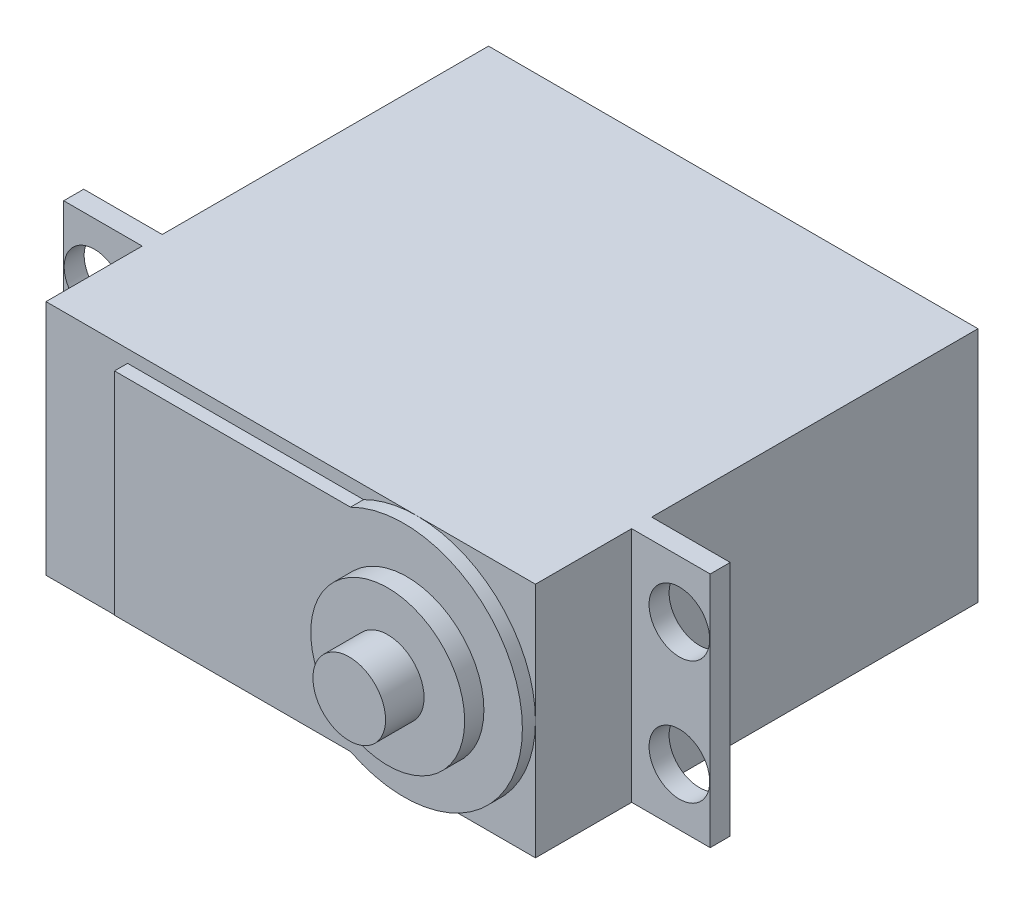
ISO-10303-21;
HEADER;
FILE_DESCRIPTION(('STEP AP214'),'2;1');
FILE_NAME('part.step','',(''),(''),'','','');
FILE_SCHEMA(('AUTOMOTIVE_DESIGN { 1 0 10303 214 1 1 1 1 }'));
ENDSEC;
DATA;
#1=APPLICATION_CONTEXT('core data for automotive mechanical design processes');
#2=APPLICATION_PROTOCOL_DEFINITION('international standard','automotive_design',2000,#1);
#3=PRODUCT_CONTEXT('',#1,'mechanical');
#4=PRODUCT('Part','Part','',(#3));
#5=PRODUCT_RELATED_PRODUCT_CATEGORY('part','',(#4));
#6=PRODUCT_DEFINITION_FORMATION('','',#4);
#7=PRODUCT_DEFINITION_CONTEXT('part definition',#1,'design');
#8=PRODUCT_DEFINITION('design','',#6,#7);
#9=PRODUCT_DEFINITION_SHAPE('','',#8);
#10=(LENGTH_UNIT() NAMED_UNIT(*) SI_UNIT(.MILLI.,.METRE.));
#11=(NAMED_UNIT(*) PLANE_ANGLE_UNIT() SI_UNIT($,.RADIAN.));
#12=(NAMED_UNIT(*) SI_UNIT($,.STERADIAN.) SOLID_ANGLE_UNIT());
#13=UNCERTAINTY_MEASURE_WITH_UNIT(LENGTH_MEASURE(1.E-05),#10,'distance_accuracy_value','');
#14=(GEOMETRIC_REPRESENTATION_CONTEXT(3) GLOBAL_UNCERTAINTY_ASSIGNED_CONTEXT((#13)) GLOBAL_UNIT_ASSIGNED_CONTEXT((#10,
#11,#12)) REPRESENTATION_CONTEXT('',''));
#15=CARTESIAN_POINT('',(0.,0.,0.));
#16=DIRECTION('',(0.,0.,1.));
#17=DIRECTION('',(1.,0.,0.));
#18=AXIS2_PLACEMENT_3D('',#15,#16,#17);
#19=CARTESIAN_POINT('',(0.,0.,36.5125));
#20=DIRECTION('',(0.,0.,1.));
#21=DIRECTION('',(1.,0.,0.));
#22=AXIS2_PLACEMENT_3D('',#19,#20,#21);
#23=PLANE('',#22);
#24=CARTESIAN_POINT('',(-43.1606186472595,-12.9670800765665,36.5125));
#25=DIRECTION('',(0.,0.,1.));
#26=DIRECTION('',(1.,0.,0.));
#27=AXIS2_PLACEMENT_3D('',#24,#25,#26);
#28=CIRCLE('',#27,9.779);
#29=CARTESIAN_POINT('',(-47.5644935816213,-21.6983300765665,36.5125));
#30=VERTEX_POINT('',#29);
#31=CARTESIAN_POINT('',(-43.1606186472595,-22.7460800765665,36.5125));
#32=VERTEX_POINT('',#31);
#33=EDGE_CURVE('E45',#30,#32,#28,.T.);
#34=ORIENTED_EDGE('',*,*,#33,.F.);
#35=DIRECTION('',(-1.,0.,0.));
#36=VECTOR('',#35,1.);
#37=CARTESIAN_POINT('',(0.,-21.6983300765665,36.5125));
#38=LINE('',#37,#36);
#39=CARTESIAN_POINT('',(-67.0366186472595,-21.6983300765665,36.5125));
#40=VERTEX_POINT('',#39);
#41=EDGE_CURVE('E52',#30,#40,#38,.T.);
#42=ORIENTED_EDGE('',*,*,#41,.T.);
#43=DIRECTION('',(0.,1.,0.));
#44=VECTOR('',#43,1.);
#45=CARTESIAN_POINT('',(-67.0366186472595,0.,36.5125));
#46=LINE('',#45,#44);
#47=CARTESIAN_POINT('',(-67.0366186472595,-4.23583007656654,36.5125));
#48=VERTEX_POINT('',#47);
#49=EDGE_CURVE('E57',#40,#48,#46,.T.);
#50=ORIENTED_EDGE('',*,*,#49,.T.);
#51=DIRECTION('',(-1.,0.,0.));
#52=VECTOR('',#51,1.);
#53=CARTESIAN_POINT('',(0.,-4.23583007656653,36.5125));
#54=LINE('',#53,#52);
#55=CARTESIAN_POINT('',(-47.5644935816213,-4.23583007656654,36.5125));
#56=VERTEX_POINT('',#55);
#57=EDGE_CURVE('E182',#56,#48,#54,.T.);
#58=ORIENTED_EDGE('',*,*,#57,.F.);
#59=CARTESIAN_POINT('',(-43.1606186472595,-3.18808007656653,36.5125));
#60=VERTEX_POINT('',#59);
#61=EDGE_CURVE('E193',#60,#56,#28,.T.);
#62=ORIENTED_EDGE('',*,*,#61,.F.);
#63=DIRECTION('',(-1.,0.,0.));
#64=VECTOR('',#63,1.);
#65=CARTESIAN_POINT('',(-73.7676186472595,-3.18808007656653,36.5125));
#66=LINE('',#65,#64);
#67=CARTESIAN_POINT('',(-73.7676186472595,-3.18808007656653,36.5125));
#68=VERTEX_POINT('',#67);
#69=EDGE_CURVE('E212',#60,#68,#66,.T.);
#70=ORIENTED_EDGE('',*,*,#69,.T.);
#71=DIRECTION('',(0.,-1.,0.));
#72=VECTOR('',#71,1.);
#73=CARTESIAN_POINT('',(-73.7676186472595,-3.18808007656653,36.5125));
#74=LINE('',#73,#72);
#75=CARTESIAN_POINT('',(-73.7676186472595,-22.7460800765665,36.5125));
#76=VERTEX_POINT('',#75);
#77=EDGE_CURVE('E200',#68,#76,#74,.T.);
#78=ORIENTED_EDGE('',*,*,#77,.T.);
#79=DIRECTION('',(1.,0.,0.));
#80=VECTOR('',#79,1.);
#81=CARTESIAN_POINT('',(-73.7676186472595,-22.7460800765665,36.5125));
#82=LINE('',#81,#80);
#83=EDGE_CURVE('E205',#76,#32,#82,.T.);
#84=ORIENTED_EDGE('',*,*,#83,.T.);
#85=EDGE_LOOP('',(#34,#42,#50,#58,#62,#70,#78,#84));
#86=FACE_BOUND('',#85,.T.);
#87=ADVANCED_FACE('F34',(#86),#23,.T.);
#88=CARTESIAN_POINT('',(-33.3816186472595,-12.9670800765665,36.5125));
#89=VERTEX_POINT('',#88);
#90=EDGE_CURVE('E11',#32,#89,#28,.T.);
#91=ORIENTED_EDGE('',*,*,#90,.F.);
#92=CARTESIAN_POINT('',(-33.3816186472595,-22.7460800765665,36.5125));
#93=VERTEX_POINT('',#92);
#94=EDGE_CURVE('E203',#32,#93,#82,.T.);
#95=ORIENTED_EDGE('',*,*,#94,.T.);
#96=DIRECTION('',(0.,1.,0.));
#97=VECTOR('',#96,1.);
#98=CARTESIAN_POINT('',(-33.3816186472595,-3.18808007656653,36.5125));
#99=LINE('',#98,#97);
#100=EDGE_CURVE('E209',#93,#89,#99,.T.);
#101=ORIENTED_EDGE('',*,*,#100,.T.);
#102=EDGE_LOOP('',(#91,#95,#101));
#103=FACE_BOUND('',#102,.T.);
#104=ADVANCED_FACE('F407',(#103),#23,.T.);
#105=CARTESIAN_POINT('',(0.,0.,28.575));
#106=DIRECTION('',(0.,0.,1.));
#107=DIRECTION('',(1.,0.,0.));
#108=AXIS2_PLACEMENT_3D('',#105,#106,#107);
#109=PLANE('',#108);
#110=DIRECTION('',(0.,-1.,0.));
#111=VECTOR('',#110,1.);
#112=CARTESIAN_POINT('',(-73.7676186472595,-3.18808007656653,28.575));
#113=LINE('',#112,#111);
#114=CARTESIAN_POINT('',(-73.7676186472595,-3.18808007656653,28.575));
#115=VERTEX_POINT('',#114);
#116=CARTESIAN_POINT('',(-73.7676186472595,-22.7460800765665,28.575));
#117=VERTEX_POINT('',#116);
#118=EDGE_CURVE('E166',#115,#117,#113,.T.);
#119=ORIENTED_EDGE('',*,*,#118,.F.);
#120=DIRECTION('',(-1.,0.,0.));
#121=VECTOR('',#120,1.);
#122=CARTESIAN_POINT('',(-80.2446186472595,-3.18808007656653,28.575));
#123=LINE('',#122,#121);
#124=CARTESIAN_POINT('',(-80.2446186472595,-3.18808007656653,28.575));
#125=VERTEX_POINT('',#124);
#126=EDGE_CURVE('E389',#115,#125,#123,.T.);
#127=ORIENTED_EDGE('',*,*,#126,.T.);
#128=DIRECTION('',(0.,-1.,0.));
#129=VECTOR('',#128,1.);
#130=CARTESIAN_POINT('',(-80.2446186472595,-3.18808007656653,28.575));
#131=LINE('',#130,#129);
#132=CARTESIAN_POINT('',(-80.2446186472595,-22.7460800765665,28.575));
#133=VERTEX_POINT('',#132);
#134=EDGE_CURVE('E277',#125,#133,#131,.T.);
#135=ORIENTED_EDGE('',*,*,#134,.T.);
#136=DIRECTION('',(1.,0.,0.));
#137=VECTOR('',#136,1.);
#138=CARTESIAN_POINT('',(-80.2446186472595,-22.7460800765665,28.575));
#139=LINE('',#138,#137);
#140=EDGE_CURVE('E290',#133,#117,#139,.T.);
#141=ORIENTED_EDGE('',*,*,#140,.T.);
#142=EDGE_LOOP('',(#119,#127,#135,#141));
#143=FACE_BOUND('',#142,.T.);
#144=CARTESIAN_POINT('',(-77.7046186472595,-7.88708007656653,28.575));
#145=DIRECTION('',(0.,0.,1.));
#146=DIRECTION('',(1.,0.,0.));
#147=AXIS2_PLACEMENT_3D('',#144,#145,#146);
#148=CIRCLE('',#147,2.50190000000001);
#149=CARTESIAN_POINT('',(-75.2027186472595,-7.88708007656653,28.575));
#150=VERTEX_POINT('',#149);
#151=EDGE_CURVE('E270',#150,#150,#148,.T.);
#152=ORIENTED_EDGE('',*,*,#151,.F.);
#153=EDGE_LOOP('',(#152));
#154=FACE_BOUND('',#153,.T.);
#155=CARTESIAN_POINT('',(-77.7046186472594,-18.0470800765665,28.575));
#156=DIRECTION('',(0.,0.,1.));
#157=DIRECTION('',(1.,0.,0.));
#158=AXIS2_PLACEMENT_3D('',#155,#156,#157);
#159=CIRCLE('',#158,2.5019);
#160=CARTESIAN_POINT('',(-75.2027186472594,-18.0470800765665,28.575));
#161=VERTEX_POINT('',#160);
#162=EDGE_CURVE('E248',#161,#161,#159,.T.);
#163=ORIENTED_EDGE('',*,*,#162,.F.);
#164=EDGE_LOOP('',(#163));
#165=FACE_BOUND('',#164,.T.);
#166=ADVANCED_FACE('F411',(#143,#154,#165),#109,.T.);
#167=CARTESIAN_POINT('',(-73.7676186472595,-3.18808007656653,26.924));
#168=DIRECTION('',(1.,0.,0.));
#169=DIRECTION('',(0.,0.,-1.));
#170=AXIS2_PLACEMENT_3D('',#167,#168,#169);
#171=PLANE('',#170);
#172=DIRECTION('',(0.,-1.,0.));
#173=VECTOR('',#172,1.);
#174=CARTESIAN_POINT('',(-73.7676186472595,-3.18808007656653,0.));
#175=LINE('',#174,#173);
#176=CARTESIAN_POINT('',(-73.7676186472595,-3.18808007656653,0.));
#177=VERTEX_POINT('',#176);
#178=CARTESIAN_POINT('',(-73.7676186472595,-22.7460800765665,0.));
#179=VERTEX_POINT('',#178);
#180=EDGE_CURVE('E320',#177,#179,#175,.T.);
#181=ORIENTED_EDGE('',*,*,#180,.T.);
#182=DIRECTION('',(0.,0.,-1.));
#183=VECTOR('',#182,1.);
#184=CARTESIAN_POINT('',(-73.7676186472595,-22.7460800765665,26.924));
#185=LINE('',#184,#183);
#186=CARTESIAN_POINT('',(-73.7676186472595,-22.7460800765665,26.924));
#187=VERTEX_POINT('',#186);
#188=EDGE_CURVE('E301',#187,#179,#185,.T.);
#189=ORIENTED_EDGE('',*,*,#188,.F.);
#190=DIRECTION('',(0.,-1.,0.));
#191=VECTOR('',#190,1.);
#192=CARTESIAN_POINT('',(-73.7676186472595,-3.18808007656653,26.924));
#193=LINE('',#192,#191);
#194=CARTESIAN_POINT('',(-73.7676186472595,-3.18808007656653,26.924));
#195=VERTEX_POINT('',#194);
#196=EDGE_CURVE('E305',#195,#187,#193,.T.);
#197=ORIENTED_EDGE('',*,*,#196,.F.);
#198=DIRECTION('',(0.,0.,-1.));
#199=VECTOR('',#198,1.);
#200=CARTESIAN_POINT('',(-73.7676186472595,-3.18808007656653,26.924));
#201=LINE('',#200,#199);
#202=EDGE_CURVE('E294',#195,#177,#201,.T.);
#203=ORIENTED_EDGE('',*,*,#202,.T.);
#204=EDGE_LOOP('',(#181,#189,#197,#203));
#205=FACE_BOUND('',#204,.T.);
#206=ADVANCED_FACE('F36',(#205),#171,.F.);
#207=CARTESIAN_POINT('',(-73.7676186472595,-22.7460800765665,26.924));
#208=DIRECTION('',(0.,1.,0.));
#209=DIRECTION('',(0.,0.,1.));
#210=AXIS2_PLACEMENT_3D('',#207,#208,#209);
#211=PLANE('',#210);
#212=DIRECTION('',(1.,0.,0.));
#213=VECTOR('',#212,1.);
#214=CARTESIAN_POINT('',(-73.7676186472595,-22.7460800765665,0.));
#215=LINE('',#214,#213);
#216=CARTESIAN_POINT('',(-33.3816186472595,-22.7460800765665,0.));
#217=VERTEX_POINT('',#216);
#218=EDGE_CURVE('E337',#179,#217,#215,.T.);
#219=ORIENTED_EDGE('',*,*,#218,.T.);
#220=DIRECTION('',(0.,0.,-1.));
#221=VECTOR('',#220,1.);
#222=CARTESIAN_POINT('',(-33.3816186472595,-22.7460800765665,26.924));
#223=LINE('',#222,#221);
#224=CARTESIAN_POINT('',(-33.3816186472595,-22.7460800765665,26.924));
#225=VERTEX_POINT('',#224);
#226=EDGE_CURVE('E304',#225,#217,#223,.T.);
#227=ORIENTED_EDGE('',*,*,#226,.F.);
#228=DIRECTION('',(1.,0.,0.));
#229=VECTOR('',#228,1.);
#230=CARTESIAN_POINT('',(-80.2446186472595,-22.7460800765665,26.924));
#231=LINE('',#230,#229);
#232=CARTESIAN_POINT('',(-26.9046186472595,-22.7460800765665,26.924));
#233=VERTEX_POINT('',#232);
#234=EDGE_CURVE('E315',#225,#233,#231,.T.);
#235=ORIENTED_EDGE('',*,*,#234,.T.);
#236=DIRECTION('',(0.,0.,-1.));
#237=VECTOR('',#236,1.);
#238=CARTESIAN_POINT('',(-26.9046186472595,-22.7460800765665,28.575));
#239=LINE('',#238,#237);
#240=CARTESIAN_POINT('',(-26.9046186472595,-22.7460800765665,28.575));
#241=VERTEX_POINT('',#240);
#242=EDGE_CURVE('E343',#241,#233,#239,.T.);
#243=ORIENTED_EDGE('',*,*,#242,.F.);
#244=CARTESIAN_POINT('',(-33.3816186472595,-22.7460800765665,28.575));
#245=VERTEX_POINT('',#244);
#246=EDGE_CURVE('E280',#245,#241,#139,.T.);
#247=ORIENTED_EDGE('',*,*,#246,.F.);
#248=DIRECTION('',(0.,0.,-1.));
#249=VECTOR('',#248,1.);
#250=CARTESIAN_POINT('',(-33.3816186472595,-22.7460800765665,36.5125));
#251=LINE('',#250,#249);
#252=EDGE_CURVE('E232',#93,#245,#251,.T.);
#253=ORIENTED_EDGE('',*,*,#252,.F.);
#254=ORIENTED_EDGE('',*,*,#94,.F.);
#255=ORIENTED_EDGE('',*,*,#83,.F.);
#256=DIRECTION('',(0.,0.,-1.));
#257=VECTOR('',#256,1.);
#258=CARTESIAN_POINT('',(-73.7676186472595,-22.7460800765665,36.5125));
#259=LINE('',#258,#257);
#260=EDGE_CURVE('E239',#76,#117,#259,.T.);
#261=ORIENTED_EDGE('',*,*,#260,.T.);
#262=ORIENTED_EDGE('',*,*,#140,.F.);
#263=DIRECTION('',(0.,0.,-1.));
#264=VECTOR('',#263,1.);
#265=CARTESIAN_POINT('',(-80.2446186472595,-22.7460800765665,28.575));
#266=LINE('',#265,#264);
#267=CARTESIAN_POINT('',(-80.2446186472595,-22.7460800765665,26.924));
#268=VERTEX_POINT('',#267);
#269=EDGE_CURVE('E339',#133,#268,#266,.T.);
#270=ORIENTED_EDGE('',*,*,#269,.T.);
#271=EDGE_CURVE('E383',#268,#187,#231,.T.);
#272=ORIENTED_EDGE('',*,*,#271,.T.);
#273=ORIENTED_EDGE('',*,*,#188,.T.);
#274=EDGE_LOOP('',(#219,#227,#235,#243,#247,#253,#254,#255,#261,#262,#270,#272,#273));
#275=FACE_BOUND('',#274,.T.);
#276=ADVANCED_FACE('F399',(#275),#211,.F.);
#277=CARTESIAN_POINT('',(-33.3816186472595,-3.18808007656653,26.924));
#278=DIRECTION('',(-1.,0.,0.));
#279=DIRECTION('',(0.,0.,1.));
#280=AXIS2_PLACEMENT_3D('',#277,#278,#279);
#281=PLANE('',#280);
#282=DIRECTION('',(0.,1.,0.));
#283=VECTOR('',#282,1.);
#284=CARTESIAN_POINT('',(-33.3816186472595,-3.18808007656653,0.));
#285=LINE('',#284,#283);
#286=CARTESIAN_POINT('',(-33.3816186472595,-3.18808007656653,0.));
#287=VERTEX_POINT('',#286);
#288=EDGE_CURVE('E336',#217,#287,#285,.T.);
#289=ORIENTED_EDGE('',*,*,#288,.T.);
#290=DIRECTION('',(0.,0.,-1.));
#291=VECTOR('',#290,1.);
#292=CARTESIAN_POINT('',(-33.3816186472595,-3.18808007656653,26.924));
#293=LINE('',#292,#291);
#294=CARTESIAN_POINT('',(-33.3816186472595,-3.18808007656653,26.924));
#295=VERTEX_POINT('',#294);
#296=EDGE_CURVE('E297',#295,#287,#293,.T.);
#297=ORIENTED_EDGE('',*,*,#296,.F.);
#298=DIRECTION('',(0.,1.,0.));
#299=VECTOR('',#298,1.);
#300=CARTESIAN_POINT('',(-33.3816186472595,-3.18808007656653,26.924));
#301=LINE('',#300,#299);
#302=EDGE_CURVE('E298',#225,#295,#301,.T.);
#303=ORIENTED_EDGE('',*,*,#302,.F.);
#304=ORIENTED_EDGE('',*,*,#226,.T.);
#305=EDGE_LOOP('',(#289,#297,#303,#304));
#306=FACE_BOUND('',#305,.T.);
#307=ADVANCED_FACE('F374',(#306),#281,.F.);
#308=CARTESIAN_POINT('',(-73.7676186472595,-3.18808007656653,26.924));
#309=DIRECTION('',(0.,-1.,0.));
#310=DIRECTION('',(0.,0.,-1.));
#311=AXIS2_PLACEMENT_3D('',#308,#309,#310);
#312=PLANE('',#311);
#313=DIRECTION('',(-1.,0.,0.));
#314=VECTOR('',#313,1.);
#315=CARTESIAN_POINT('',(-73.7676186472595,-3.18808007656653,0.));
#316=LINE('',#315,#314);
#317=EDGE_CURVE('E309',#287,#177,#316,.T.);
#318=ORIENTED_EDGE('',*,*,#317,.T.);
#319=ORIENTED_EDGE('',*,*,#202,.F.);
#320=DIRECTION('',(-1.,0.,0.));
#321=VECTOR('',#320,1.);
#322=CARTESIAN_POINT('',(-80.2446186472595,-3.18808007656653,26.924));
#323=LINE('',#322,#321);
#324=CARTESIAN_POINT('',(-80.2446186472595,-3.18808007656653,26.924));
#325=VERTEX_POINT('',#324);
#326=EDGE_CURVE('E355',#195,#325,#323,.T.);
#327=ORIENTED_EDGE('',*,*,#326,.T.);
#328=DIRECTION('',(0.,0.,-1.));
#329=VECTOR('',#328,1.);
#330=CARTESIAN_POINT('',(-80.2446186472595,-3.18808007656653,28.575));
#331=LINE('',#330,#329);
#332=EDGE_CURVE('E360',#125,#325,#331,.T.);
#333=ORIENTED_EDGE('',*,*,#332,.F.);
#334=ORIENTED_EDGE('',*,*,#126,.F.);
#335=DIRECTION('',(0.,0.,-1.));
#336=VECTOR('',#335,1.);
#337=CARTESIAN_POINT('',(-73.7676186472595,-3.18808007656653,36.5125));
#338=LINE('',#337,#336);
#339=EDGE_CURVE('E216',#68,#115,#338,.T.);
#340=ORIENTED_EDGE('',*,*,#339,.F.);
#341=ORIENTED_EDGE('',*,*,#69,.F.);
#342=CARTESIAN_POINT('',(-33.3816186472595,-3.18808007656653,36.5125));
#343=VERTEX_POINT('',#342);
#344=EDGE_CURVE('E213',#343,#60,#66,.T.);
#345=ORIENTED_EDGE('',*,*,#344,.F.);
#346=DIRECTION('',(0.,0.,-1.));
#347=VECTOR('',#346,1.);
#348=CARTESIAN_POINT('',(-33.3816186472595,-3.18808007656653,36.5125));
#349=LINE('',#348,#347);
#350=CARTESIAN_POINT('',(-33.3816186472595,-3.18808007656653,28.575));
#351=VERTEX_POINT('',#350);
#352=EDGE_CURVE('E227',#343,#351,#349,.T.);
#353=ORIENTED_EDGE('',*,*,#352,.T.);
#354=CARTESIAN_POINT('',(-26.9046186472595,-3.18808007656653,28.575));
#355=VERTEX_POINT('',#354);
#356=EDGE_CURVE('E363',#355,#351,#123,.T.);
#357=ORIENTED_EDGE('',*,*,#356,.F.);
#358=DIRECTION('',(0.,0.,-1.));
#359=VECTOR('',#358,1.);
#360=CARTESIAN_POINT('',(-26.9046186472595,-3.18808007656653,28.575));
#361=LINE('',#360,#359);
#362=CARTESIAN_POINT('',(-26.9046186472595,-3.18808007656653,26.924));
#363=VERTEX_POINT('',#362);
#364=EDGE_CURVE('E349',#355,#363,#361,.T.);
#365=ORIENTED_EDGE('',*,*,#364,.T.);
#366=EDGE_CURVE('E281',#363,#295,#323,.T.);
#367=ORIENTED_EDGE('',*,*,#366,.T.);
#368=ORIENTED_EDGE('',*,*,#296,.T.);
#369=EDGE_LOOP('',(#318,#319,#327,#333,#334,#340,#341,#345,#353,#357,#365,#367,#368));
#370=FACE_BOUND('',#369,.T.);
#371=ADVANCED_FACE('F367',(#370),#312,.F.);
#372=CARTESIAN_POINT('',(0.,0.,0.));
#373=DIRECTION('',(0.,0.,1.));
#374=DIRECTION('',(1.,0.,0.));
#375=AXIS2_PLACEMENT_3D('',#372,#373,#374);
#376=PLANE('',#375);
#377=ORIENTED_EDGE('',*,*,#180,.F.);
#378=ORIENTED_EDGE('',*,*,#317,.F.);
#379=ORIENTED_EDGE('',*,*,#288,.F.);
#380=ORIENTED_EDGE('',*,*,#218,.F.);
#381=EDGE_LOOP('',(#377,#378,#379,#380));
#382=FACE_BOUND('',#381,.T.);
#383=ADVANCED_FACE('F376',(#382),#376,.F.);
#384=CARTESIAN_POINT('',(0.,0.,26.924));
#385=DIRECTION('',(0.,0.,1.));
#386=DIRECTION('',(1.,0.,0.));
#387=AXIS2_PLACEMENT_3D('',#384,#385,#386);
#388=PLANE('',#387);
#389=CARTESIAN_POINT('',(-77.7046186472594,-18.0470800765665,26.924));
#390=DIRECTION('',(0.,0.,1.));
#391=DIRECTION('',(1.,0.,0.));
#392=AXIS2_PLACEMENT_3D('',#389,#390,#391);
#393=CIRCLE('',#392,2.5019);
#394=CARTESIAN_POINT('',(-75.2027186472594,-18.0470800765665,26.924));
#395=VERTEX_POINT('',#394);
#396=EDGE_CURVE('E252',#395,#395,#393,.T.);
#397=ORIENTED_EDGE('',*,*,#396,.T.);
#398=EDGE_LOOP('',(#397));
#399=FACE_BOUND('',#398,.T.);
#400=CARTESIAN_POINT('',(-77.7046186472595,-7.88708007656653,26.924));
#401=DIRECTION('',(0.,0.,1.));
#402=DIRECTION('',(1.,0.,0.));
#403=AXIS2_PLACEMENT_3D('',#400,#401,#402);
#404=CIRCLE('',#403,2.50190000000001);
#405=CARTESIAN_POINT('',(-75.2027186472595,-7.88708007656653,26.924));
#406=VERTEX_POINT('',#405);
#407=EDGE_CURVE('E273',#406,#406,#404,.T.);
#408=ORIENTED_EDGE('',*,*,#407,.T.);
#409=EDGE_LOOP('',(#408));
#410=FACE_BOUND('',#409,.T.);
#411=ORIENTED_EDGE('',*,*,#326,.F.);
#412=ORIENTED_EDGE('',*,*,#196,.T.);
#413=ORIENTED_EDGE('',*,*,#271,.F.);
#414=DIRECTION('',(0.,-1.,0.));
#415=VECTOR('',#414,1.);
#416=CARTESIAN_POINT('',(-80.2446186472595,-3.18808007656653,26.924));
#417=LINE('',#416,#415);
#418=EDGE_CURVE('E276',#325,#268,#417,.T.);
#419=ORIENTED_EDGE('',*,*,#418,.F.);
#420=EDGE_LOOP('',(#411,#412,#413,#419));
#421=FACE_BOUND('',#420,.T.);
#422=ADVANCED_FACE('F381',(#399,#410,#421),#388,.F.);
#423=CARTESIAN_POINT('',(-29.4446186472594,-18.0470800765665,26.924));
#424=DIRECTION('',(0.,0.,1.));
#425=DIRECTION('',(1.,0.,0.));
#426=AXIS2_PLACEMENT_3D('',#423,#424,#425);
#427=CIRCLE('',#426,2.5019);
#428=CARTESIAN_POINT('',(-26.9427186472594,-18.0470800765665,26.924));
#429=VERTEX_POINT('',#428);
#430=EDGE_CURVE('E261',#429,#429,#427,.T.);
#431=ORIENTED_EDGE('',*,*,#430,.T.);
#432=EDGE_LOOP('',(#431));
#433=FACE_BOUND('',#432,.T.);
#434=CARTESIAN_POINT('',(-29.4446186472595,-7.88708007656653,26.924));
#435=DIRECTION('',(0.,0.,1.));
#436=DIRECTION('',(1.,0.,0.));
#437=AXIS2_PLACEMENT_3D('',#434,#435,#436);
#438=CIRCLE('',#437,2.50190000000001);
#439=CARTESIAN_POINT('',(-26.9427186472595,-7.88708007656653,26.924));
#440=VERTEX_POINT('',#439);
#441=EDGE_CURVE('E267',#440,#440,#438,.T.);
#442=ORIENTED_EDGE('',*,*,#441,.T.);
#443=EDGE_LOOP('',(#442));
#444=FACE_BOUND('',#443,.T.);
#445=ORIENTED_EDGE('',*,*,#234,.F.);
#446=ORIENTED_EDGE('',*,*,#302,.T.);
#447=ORIENTED_EDGE('',*,*,#366,.F.);
#448=DIRECTION('',(0.,1.,0.));
#449=VECTOR('',#448,1.);
#450=CARTESIAN_POINT('',(-26.9046186472595,-3.18808007656653,26.924));
#451=LINE('',#450,#449);
#452=EDGE_CURVE('E359',#233,#363,#451,.T.);
#453=ORIENTED_EDGE('',*,*,#452,.F.);
#454=EDGE_LOOP('',(#445,#446,#447,#453));
#455=FACE_BOUND('',#454,.T.);
#456=ADVANCED_FACE('F373',(#433,#444,#455),#388,.F.);
#457=CARTESIAN_POINT('',(-80.2446186472595,-3.18808007656653,28.575));
#458=DIRECTION('',(1.,0.,0.));
#459=DIRECTION('',(0.,0.,-1.));
#460=AXIS2_PLACEMENT_3D('',#457,#458,#459);
#461=PLANE('',#460);
#462=ORIENTED_EDGE('',*,*,#418,.T.);
#463=ORIENTED_EDGE('',*,*,#269,.F.);
#464=ORIENTED_EDGE('',*,*,#134,.F.);
#465=ORIENTED_EDGE('',*,*,#332,.T.);
#466=EDGE_LOOP('',(#462,#463,#464,#465));
#467=FACE_BOUND('',#466,.T.);
#468=ADVANCED_FACE('F415',(#467),#461,.F.);
#469=CARTESIAN_POINT('',(-26.9046186472595,-3.18808007656653,28.575));
#470=DIRECTION('',(-1.,0.,0.));
#471=DIRECTION('',(0.,0.,1.));
#472=AXIS2_PLACEMENT_3D('',#469,#470,#471);
#473=PLANE('',#472);
#474=ORIENTED_EDGE('',*,*,#452,.T.);
#475=ORIENTED_EDGE('',*,*,#364,.F.);
#476=DIRECTION('',(0.,1.,0.));
#477=VECTOR('',#476,1.);
#478=CARTESIAN_POINT('',(-26.9046186472595,-3.18808007656653,28.575));
#479=LINE('',#478,#477);
#480=EDGE_CURVE('E284',#241,#355,#479,.T.);
#481=ORIENTED_EDGE('',*,*,#480,.F.);
#482=ORIENTED_EDGE('',*,*,#242,.T.);
#483=EDGE_LOOP('',(#474,#475,#481,#482));
#484=FACE_BOUND('',#483,.T.);
#485=ADVANCED_FACE('F398',(#484),#473,.F.);
#486=DIRECTION('',(0.,1.,0.));
#487=VECTOR('',#486,1.);
#488=CARTESIAN_POINT('',(-33.3816186472595,-3.18808007656653,28.575));
#489=LINE('',#488,#487);
#490=EDGE_CURVE('E204',#245,#351,#489,.T.);
#491=ORIENTED_EDGE('',*,*,#490,.F.);
#492=ORIENTED_EDGE('',*,*,#246,.T.);
#493=ORIENTED_EDGE('',*,*,#480,.T.);
#494=ORIENTED_EDGE('',*,*,#356,.T.);
#495=EDGE_LOOP('',(#491,#492,#493,#494));
#496=FACE_BOUND('',#495,.T.);
#497=CARTESIAN_POINT('',(-29.4446186472594,-18.0470800765665,28.575));
#498=DIRECTION('',(0.,0.,1.));
#499=DIRECTION('',(1.,0.,0.));
#500=AXIS2_PLACEMENT_3D('',#497,#498,#499);
#501=CIRCLE('',#500,2.5019);
#502=CARTESIAN_POINT('',(-26.9427186472594,-18.0470800765665,28.575));
#503=VERTEX_POINT('',#502);
#504=EDGE_CURVE('E256',#503,#503,#501,.T.);
#505=ORIENTED_EDGE('',*,*,#504,.F.);
#506=EDGE_LOOP('',(#505));
#507=FACE_BOUND('',#506,.T.);
#508=CARTESIAN_POINT('',(-29.4446186472595,-7.88708007656653,28.575));
#509=DIRECTION('',(0.,0.,1.));
#510=DIRECTION('',(1.,0.,0.));
#511=AXIS2_PLACEMENT_3D('',#508,#509,#510);
#512=CIRCLE('',#511,2.50190000000001);
#513=CARTESIAN_POINT('',(-26.9427186472595,-7.88708007656653,28.575));
#514=VERTEX_POINT('',#513);
#515=EDGE_CURVE('E264',#514,#514,#512,.T.);
#516=ORIENTED_EDGE('',*,*,#515,.F.);
#517=EDGE_LOOP('',(#516));
#518=FACE_BOUND('',#517,.T.);
#519=ADVANCED_FACE('F394',(#496,#507,#518),#109,.T.);
#520=CARTESIAN_POINT('',(-77.7046186472595,-7.88708007656653,25.4));
#521=DIRECTION('',(0.,0.,1.));
#522=DIRECTION('',(1.,0.,0.));
#523=AXIS2_PLACEMENT_3D('',#520,#521,#522);
#524=CYLINDRICAL_SURFACE('',#523,2.50190000000001);
#525=ORIENTED_EDGE('',*,*,#151,.T.);
#526=EDGE_LOOP('',(#525));
#527=FACE_BOUND('',#526,.T.);
#528=ORIENTED_EDGE('',*,*,#407,.F.);
#529=EDGE_LOOP('',(#528));
#530=FACE_BOUND('',#529,.T.);
#531=ADVANCED_FACE('F619',(#527,#530),#524,.F.);
#532=CARTESIAN_POINT('',(-29.4446186472595,-7.88708007656653,25.4));
#533=DIRECTION('',(0.,0.,1.));
#534=DIRECTION('',(1.,0.,0.));
#535=AXIS2_PLACEMENT_3D('',#532,#533,#534);
#536=CYLINDRICAL_SURFACE('',#535,2.50190000000001);
#537=ORIENTED_EDGE('',*,*,#515,.T.);
#538=EDGE_LOOP('',(#537));
#539=FACE_BOUND('',#538,.T.);
#540=ORIENTED_EDGE('',*,*,#441,.F.);
#541=EDGE_LOOP('',(#540));
#542=FACE_BOUND('',#541,.T.);
#543=ADVANCED_FACE('F610',(#539,#542),#536,.F.);
#544=CARTESIAN_POINT('',(-29.4446186472594,-18.0470800765665,25.4));
#545=DIRECTION('',(0.,0.,1.));
#546=DIRECTION('',(1.,0.,0.));
#547=AXIS2_PLACEMENT_3D('',#544,#545,#546);
#548=CYLINDRICAL_SURFACE('',#547,2.5019);
#549=ORIENTED_EDGE('',*,*,#504,.T.);
#550=EDGE_LOOP('',(#549));
#551=FACE_BOUND('',#550,.T.);
#552=ORIENTED_EDGE('',*,*,#430,.F.);
#553=EDGE_LOOP('',(#552));
#554=FACE_BOUND('',#553,.T.);
#555=ADVANCED_FACE('F602',(#551,#554),#548,.F.);
#556=CARTESIAN_POINT('',(-77.7046186472594,-18.0470800765665,25.4));
#557=DIRECTION('',(0.,0.,1.));
#558=DIRECTION('',(1.,0.,0.));
#559=AXIS2_PLACEMENT_3D('',#556,#557,#558);
#560=CYLINDRICAL_SURFACE('',#559,2.5019);
#561=ORIENTED_EDGE('',*,*,#162,.T.);
#562=EDGE_LOOP('',(#561));
#563=FACE_BOUND('',#562,.T.);
#564=ORIENTED_EDGE('',*,*,#396,.F.);
#565=EDGE_LOOP('',(#564));
#566=FACE_BOUND('',#565,.T.);
#567=ADVANCED_FACE('F565',(#563,#566),#560,.F.);
#568=CARTESIAN_POINT('',(-73.7676186472595,-3.18808007656653,36.5125));
#569=DIRECTION('',(1.,0.,0.));
#570=DIRECTION('',(0.,0.,-1.));
#571=AXIS2_PLACEMENT_3D('',#568,#569,#570);
#572=PLANE('',#571);
#573=ORIENTED_EDGE('',*,*,#118,.T.);
#574=ORIENTED_EDGE('',*,*,#260,.F.);
#575=ORIENTED_EDGE('',*,*,#77,.F.);
#576=ORIENTED_EDGE('',*,*,#339,.T.);
#577=EDGE_LOOP('',(#573,#574,#575,#576));
#578=FACE_BOUND('',#577,.T.);
#579=ADVANCED_FACE('F410',(#578),#572,.F.);
#580=CARTESIAN_POINT('',(-33.3816186472595,-3.18808007656653,36.5125));
#581=DIRECTION('',(-1.,0.,0.));
#582=DIRECTION('',(0.,0.,1.));
#583=AXIS2_PLACEMENT_3D('',#580,#581,#582);
#584=PLANE('',#583);
#585=ORIENTED_EDGE('',*,*,#490,.T.);
#586=ORIENTED_EDGE('',*,*,#352,.F.);
#587=EDGE_CURVE('E208',#89,#343,#99,.T.);
#588=ORIENTED_EDGE('',*,*,#587,.F.);
#589=ORIENTED_EDGE('',*,*,#100,.F.);
#590=ORIENTED_EDGE('',*,*,#252,.T.);
#591=EDGE_LOOP('',(#585,#586,#588,#589,#590));
#592=FACE_BOUND('',#591,.T.);
#593=ADVANCED_FACE('F404',(#592),#584,.F.);
#594=EDGE_CURVE('E43',#89,#60,#28,.T.);
#595=ORIENTED_EDGE('',*,*,#594,.F.);
#596=ORIENTED_EDGE('',*,*,#587,.T.);
#597=ORIENTED_EDGE('',*,*,#344,.T.);
#598=EDGE_LOOP('',(#595,#596,#597));
#599=FACE_BOUND('',#598,.T.);
#600=ADVANCED_FACE('F428',(#599),#23,.T.);
#601=CARTESIAN_POINT('',(0.,-21.6983300765665,37.592));
#602=DIRECTION('',(0.,-1.,0.));
#603=DIRECTION('',(1.,0.,0.));
#604=AXIS2_PLACEMENT_3D('',#601,#602,#603);
#605=PLANE('',#604);
#606=ORIENTED_EDGE('',*,*,#41,.F.);
#607=DIRECTION('',(0.,0.,-1.));
#608=VECTOR('',#607,1.);
#609=CARTESIAN_POINT('',(-47.5644935816213,-21.6983300765665,37.592));
#610=LINE('',#609,#608);
#611=CARTESIAN_POINT('',(-47.5644935816213,-21.6983300765665,37.592));
#612=VERTEX_POINT('',#611);
#613=EDGE_CURVE('E158',#612,#30,#610,.T.);
#614=ORIENTED_EDGE('',*,*,#613,.F.);
#615=DIRECTION('',(-1.,0.,0.));
#616=VECTOR('',#615,1.);
#617=CARTESIAN_POINT('',(0.,-21.6983300765665,37.592));
#618=LINE('',#617,#616);
#619=CARTESIAN_POINT('',(-67.0366186472595,-21.6983300765665,37.592));
#620=VERTEX_POINT('',#619);
#621=EDGE_CURVE('E162',#612,#620,#618,.T.);
#622=ORIENTED_EDGE('',*,*,#621,.T.);
#623=DIRECTION('',(0.,0.,-1.));
#624=VECTOR('',#623,1.);
#625=CARTESIAN_POINT('',(-67.0366186472595,-21.6983300765665,37.592));
#626=LINE('',#625,#624);
#627=EDGE_CURVE('E190',#620,#40,#626,.T.);
#628=ORIENTED_EDGE('',*,*,#627,.T.);
#629=EDGE_LOOP('',(#606,#614,#622,#628));
#630=FACE_BOUND('',#629,.T.);
#631=ADVANCED_FACE('F160',(#630),#605,.T.);
#632=CARTESIAN_POINT('',(-43.1606186472595,-12.9670800765665,37.592));
#633=DIRECTION('',(0.,0.,-1.));
#634=DIRECTION('',(-1.,0.,0.));
#635=AXIS2_PLACEMENT_3D('',#632,#633,#634);
#636=CYLINDRICAL_SURFACE('',#635,9.779);
#637=ORIENTED_EDGE('',*,*,#33,.T.);
#638=ORIENTED_EDGE('',*,*,#90,.T.);
#639=ORIENTED_EDGE('',*,*,#594,.T.);
#640=ORIENTED_EDGE('',*,*,#61,.T.);
#641=DIRECTION('',(0.,0.,-1.));
#642=VECTOR('',#641,1.);
#643=CARTESIAN_POINT('',(-47.5644935816213,-4.23583007656654,37.592));
#644=LINE('',#643,#642);
#645=CARTESIAN_POINT('',(-47.5644935816213,-4.23583007656654,37.592));
#646=VERTEX_POINT('',#645);
#647=EDGE_CURVE('E167',#646,#56,#644,.T.);
#648=ORIENTED_EDGE('',*,*,#647,.F.);
#649=CARTESIAN_POINT('',(-43.1606186472595,-12.9670800765665,37.592));
#650=DIRECTION('',(0.,0.,1.));
#651=DIRECTION('',(1.,0.,0.));
#652=AXIS2_PLACEMENT_3D('',#649,#650,#651);
#653=CIRCLE('',#652,9.779);
#654=EDGE_CURVE('E170',#612,#646,#653,.T.);
#655=ORIENTED_EDGE('',*,*,#654,.F.);
#656=ORIENTED_EDGE('',*,*,#613,.T.);
#657=EDGE_LOOP('',(#637,#638,#639,#640,#648,#655,#656));
#658=FACE_BOUND('',#657,.T.);
#659=ADVANCED_FACE('F171',(#658),#636,.T.);
#660=CARTESIAN_POINT('',(0.,-4.23583007656653,37.592));
#661=DIRECTION('',(0.,-1.,0.));
#662=DIRECTION('',(1.,0.,0.));
#663=AXIS2_PLACEMENT_3D('',#660,#661,#662);
#664=PLANE('',#663);
#665=ORIENTED_EDGE('',*,*,#57,.T.);
#666=DIRECTION('',(0.,0.,-1.));
#667=VECTOR('',#666,1.);
#668=CARTESIAN_POINT('',(-67.0366186472595,-4.23583007656654,37.592));
#669=LINE('',#668,#667);
#670=CARTESIAN_POINT('',(-67.0366186472595,-4.23583007656654,37.592));
#671=VERTEX_POINT('',#670);
#672=EDGE_CURVE('E197',#671,#48,#669,.T.);
#673=ORIENTED_EDGE('',*,*,#672,.F.);
#674=DIRECTION('',(-1.,0.,0.));
#675=VECTOR('',#674,1.);
#676=CARTESIAN_POINT('',(0.,-4.23583007656653,37.592));
#677=LINE('',#676,#675);
#678=EDGE_CURVE('E176',#646,#671,#677,.T.);
#679=ORIENTED_EDGE('',*,*,#678,.F.);
#680=ORIENTED_EDGE('',*,*,#647,.T.);
#681=EDGE_LOOP('',(#665,#673,#679,#680));
#682=FACE_BOUND('',#681,.T.);
#683=ADVANCED_FACE('F441',(#682),#664,.F.);
#684=CARTESIAN_POINT('',(-67.0366186472595,0.,37.592));
#685=DIRECTION('',(-1.,0.,0.));
#686=DIRECTION('',(0.,0.,1.));
#687=AXIS2_PLACEMENT_3D('',#684,#685,#686);
#688=PLANE('',#687);
#689=ORIENTED_EDGE('',*,*,#49,.F.);
#690=ORIENTED_EDGE('',*,*,#627,.F.);
#691=DIRECTION('',(0.,1.,0.));
#692=VECTOR('',#691,1.);
#693=CARTESIAN_POINT('',(-67.0366186472595,0.,37.592));
#694=LINE('',#693,#692);
#695=EDGE_CURVE('E180',#620,#671,#694,.T.);
#696=ORIENTED_EDGE('',*,*,#695,.T.);
#697=ORIENTED_EDGE('',*,*,#672,.T.);
#698=EDGE_LOOP('',(#689,#690,#696,#697));
#699=FACE_BOUND('',#698,.T.);
#700=ADVANCED_FACE('F444',(#699),#688,.T.);
#701=CARTESIAN_POINT('',(0.,0.,37.592));
#702=DIRECTION('',(0.,0.,1.));
#703=DIRECTION('',(1.,0.,0.));
#704=AXIS2_PLACEMENT_3D('',#701,#702,#703);
#705=PLANE('',#704);
#706=CARTESIAN_POINT('',(-42.9066186472595,-13.2210800765665,37.592));
#707=DIRECTION('',(0.,0.,1.));
#708=DIRECTION('',(1.,0.,0.));
#709=AXIS2_PLACEMENT_3D('',#706,#707,#708);
#710=CIRCLE('',#709,6.35);
#711=CARTESIAN_POINT('',(-36.5566186472595,-13.2210800765665,37.592));
#712=VERTEX_POINT('',#711);
#713=EDGE_CURVE('E185',#712,#712,#710,.T.);
#714=ORIENTED_EDGE('',*,*,#713,.F.);
#715=EDGE_LOOP('',(#714));
#716=FACE_BOUND('',#715,.T.);
#717=ORIENTED_EDGE('',*,*,#621,.F.);
#718=ORIENTED_EDGE('',*,*,#654,.T.);
#719=ORIENTED_EDGE('',*,*,#678,.T.);
#720=ORIENTED_EDGE('',*,*,#695,.F.);
#721=EDGE_LOOP('',(#717,#718,#719,#720));
#722=FACE_BOUND('',#721,.T.);
#723=ADVANCED_FACE('F178',(#716,#722),#705,.T.);
#724=CARTESIAN_POINT('',(-42.9066186472595,-13.2210800765665,39.1795));
#725=DIRECTION('',(0.,0.,-1.));
#726=DIRECTION('',(-1.,0.,0.));
#727=AXIS2_PLACEMENT_3D('',#724,#725,#726);
#728=CYLINDRICAL_SURFACE('',#727,6.35);
#729=CARTESIAN_POINT('',(-42.9066186472595,-13.2210800765665,39.1795));
#730=DIRECTION('',(0.,0.,1.));
#731=DIRECTION('',(1.,0.,0.));
#732=AXIS2_PLACEMENT_3D('',#729,#730,#731);
#733=CIRCLE('',#732,6.35);
#734=CARTESIAN_POINT('',(-36.5566186472595,-13.2210800765665,39.1795));
#735=VERTEX_POINT('',#734);
#736=EDGE_CURVE('E191',#735,#735,#733,.T.);
#737=ORIENTED_EDGE('',*,*,#736,.F.);
#738=EDGE_LOOP('',(#737));
#739=FACE_BOUND('',#738,.T.);
#740=ORIENTED_EDGE('',*,*,#713,.T.);
#741=EDGE_LOOP('',(#740));
#742=FACE_BOUND('',#741,.T.);
#743=ADVANCED_FACE('F451',(#739,#742),#728,.T.);
#744=CARTESIAN_POINT('',(-42.9066186472595,-13.2210800765665,39.1795));
#745=DIRECTION('',(0.,0.,1.));
#746=DIRECTION('',(1.,0.,0.));
#747=AXIS2_PLACEMENT_3D('',#744,#745,#746);
#748=PLANE('',#747);
#749=CARTESIAN_POINT('',(-42.9066186472595,-13.2210800765665,39.1795));
#750=DIRECTION('',(0.,0.,1.));
#751=DIRECTION('',(1.,0.,0.));
#752=AXIS2_PLACEMENT_3D('',#749,#750,#751);
#753=CIRCLE('',#752,2.9972);
#754=CARTESIAN_POINT('',(-39.9094186472595,-13.2210800765665,39.1795));
#755=VERTEX_POINT('',#754);
#756=EDGE_CURVE('E521',#755,#755,#753,.T.);
#757=ORIENTED_EDGE('',*,*,#756,.F.);
#758=EDGE_LOOP('',(#757));
#759=FACE_BOUND('',#758,.T.);
#760=ORIENTED_EDGE('',*,*,#736,.T.);
#761=EDGE_LOOP('',(#760));
#762=FACE_BOUND('',#761,.T.);
#763=ADVANCED_FACE('F485',(#759,#762),#748,.T.);
#764=CARTESIAN_POINT('',(-42.9066186472595,-13.2210800765665,42.3545));
#765=DIRECTION('',(0.,0.,-1.));
#766=DIRECTION('',(-1.,0.,0.));
#767=AXIS2_PLACEMENT_3D('',#764,#765,#766);
#768=CYLINDRICAL_SURFACE('',#767,2.9972);
#769=CARTESIAN_POINT('',(-42.9066186472595,-13.2210800765665,42.3545));
#770=DIRECTION('',(0.,0.,1.));
#771=DIRECTION('',(1.,0.,0.));
#772=AXIS2_PLACEMENT_3D('',#769,#770,#771);
#773=CIRCLE('',#772,2.9972);
#774=CARTESIAN_POINT('',(-39.9094186472595,-13.2210800765665,42.3545));
#775=VERTEX_POINT('',#774);
#776=EDGE_CURVE('E520',#775,#775,#773,.T.);
#777=ORIENTED_EDGE('',*,*,#776,.F.);
#778=EDGE_LOOP('',(#777));
#779=FACE_BOUND('',#778,.T.);
#780=ORIENTED_EDGE('',*,*,#756,.T.);
#781=EDGE_LOOP('',(#780));
#782=FACE_BOUND('',#781,.T.);
#783=ADVANCED_FACE('F494',(#779,#782),#768,.T.);
#784=CARTESIAN_POINT('',(-42.9066186472595,-13.2210800765665,42.3545));
#785=DIRECTION('',(0.,0.,1.));
#786=DIRECTION('',(1.,0.,0.));
#787=AXIS2_PLACEMENT_3D('',#784,#785,#786);
#788=PLANE('',#787);
#789=ORIENTED_EDGE('',*,*,#776,.T.);
#790=EDGE_LOOP('',(#789));
#791=FACE_BOUND('',#790,.T.);
#792=ADVANCED_FACE('F504',(#791),#788,.T.);
#793=CLOSED_SHELL('',(#87,#104,#166,#206,#276,#307,#371,#383,#422,#456,#468,#485,#519,#531,#543,
#555,#567,#579,#593,#600,#631,#659,#683,#700,#723,#743,#763,#783,#792));
#794=MANIFOLD_SOLID_BREP('B2',#793);
#795=ADVANCED_BREP_SHAPE_REPRESENTATION('',(#18,#794),#14);
#796=SHAPE_DEFINITION_REPRESENTATION(#9,#795);
ENDSEC;
END-ISO-10303-21;
